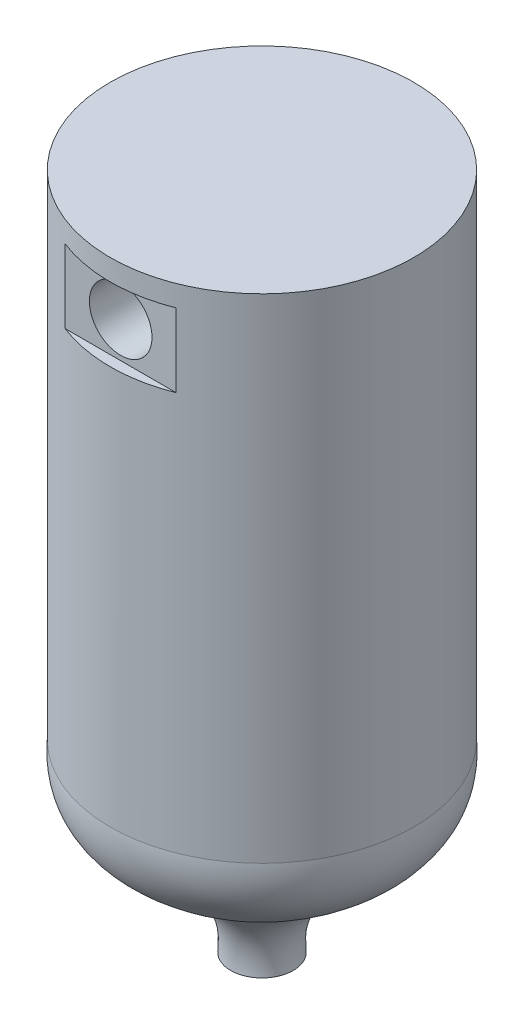
ISO-10303-21;
HEADER;
FILE_DESCRIPTION(('STEP AP214'),'2;1');
FILE_NAME('part.step','',(''),(''),'','','');
FILE_SCHEMA(('AUTOMOTIVE_DESIGN { 1 0 10303 214 1 1 1 1 }'));
ENDSEC;
DATA;
#1=APPLICATION_CONTEXT('core data for automotive mechanical design processes');
#2=APPLICATION_PROTOCOL_DEFINITION('international standard','automotive_design',2000,#1);
#3=PRODUCT_CONTEXT('',#1,'mechanical');
#4=PRODUCT('Part','Part','',(#3));
#5=PRODUCT_RELATED_PRODUCT_CATEGORY('part','',(#4));
#6=PRODUCT_DEFINITION_FORMATION('','',#4);
#7=PRODUCT_DEFINITION_CONTEXT('part definition',#1,'design');
#8=PRODUCT_DEFINITION('design','',#6,#7);
#9=PRODUCT_DEFINITION_SHAPE('','',#8);
#10=(LENGTH_UNIT() NAMED_UNIT(*) SI_UNIT(.MILLI.,.METRE.));
#11=(NAMED_UNIT(*) PLANE_ANGLE_UNIT() SI_UNIT($,.RADIAN.));
#12=(NAMED_UNIT(*) SI_UNIT($,.STERADIAN.) SOLID_ANGLE_UNIT());
#13=UNCERTAINTY_MEASURE_WITH_UNIT(LENGTH_MEASURE(1.E-05),#10,'distance_accuracy_value','');
#14=(GEOMETRIC_REPRESENTATION_CONTEXT(3) GLOBAL_UNCERTAINTY_ASSIGNED_CONTEXT((#13)) GLOBAL_UNIT_ASSIGNED_CONTEXT((#10,
#11,#12)) REPRESENTATION_CONTEXT('',''));
#15=CARTESIAN_POINT('',(0.,0.,0.));
#16=DIRECTION('',(0.,0.,1.));
#17=DIRECTION('',(1.,0.,0.));
#18=AXIS2_PLACEMENT_3D('',#15,#16,#17);
#19=CARTESIAN_POINT('',(0.,0.,0.));
#20=DIRECTION('',(0.,1.,0.));
#21=DIRECTION('',(-1.,0.,0.));
#22=AXIS2_PLACEMENT_3D('',#19,#20,#21);
#23=CYLINDRICAL_SURFACE('',#22,3.87911139565885);
#24=CARTESIAN_POINT('',(-0.8,-1.5,-3.79572196293806));
#25=CARTESIAN_POINT('',(-0.799998392782112,-1.54442061979442,-3.79572285408238));
#26=CARTESIAN_POINT('',(-0.796287694510923,-1.58886117634061,-3.79651021580194));
#27=CARTESIAN_POINT('',(-0.781556560643599,-1.67648295931771,-3.79956958912187));
#28=CARTESIAN_POINT('',(-0.770530459064854,-1.71966318250013,-3.80184275149578));
#29=CARTESIAN_POINT('',(-0.741526750116937,-1.80348402320804,-3.80760557798762));
#30=CARTESIAN_POINT('',(-0.723556286832676,-1.84412720099605,-3.81109399154105));
#31=CARTESIAN_POINT('',(-0.681193827641743,-1.92182130630489,-3.81889277096805));
#32=CARTESIAN_POINT('',(-0.656802116461452,-1.95887239300399,-3.82320310039448));
#33=CARTESIAN_POINT('',(-0.601898782214699,-2.02888891365105,-3.83223242016983));
#34=CARTESIAN_POINT('',(-0.571309052087774,-2.06179250051781,-3.8369561383317));
#35=CARTESIAN_POINT('',(-0.50504672354252,-2.12203951640586,-3.84623845275667));
#36=CARTESIAN_POINT('',(-0.469373756918443,-2.14938254229771,-3.85079703702821));
#37=CARTESIAN_POINT('',(-0.393546355098853,-2.19797377523237,-3.85928660985794));
#38=CARTESIAN_POINT('',(-0.353353351502304,-2.21916297689781,-3.86321137196339));
#39=CARTESIAN_POINT('',(-0.269882972825537,-2.25446400580391,-3.8699378807461));
#40=CARTESIAN_POINT('',(-0.226605905412446,-2.26857653788956,-3.87273973926034));
#41=CARTESIAN_POINT('',(-0.138838139613735,-2.28913044776314,-3.87687134348848));
#42=CARTESIAN_POINT('',(-0.0943728765742623,-2.2956763422445,-3.8782211278944));
#43=CARTESIAN_POINT('',(-0.00495618249461623,-2.30123747449983,-3.8793657789952));
#44=CARTESIAN_POINT('',(0.0399951983903502,-2.30025348190552,-3.87916080460239));
#45=CARTESIAN_POINT('',(0.128389185798366,-2.29086158181682,-3.87723449184737));
#46=CARTESIAN_POINT('',(0.171844331051346,-2.28256627895906,-3.87553615434167));
#47=CARTESIAN_POINT('',(0.256732269614236,-2.25896610713788,-3.87083996468401));
#48=CARTESIAN_POINT('',(0.29816497837797,-2.24366094541072,-3.8678420582564));
#49=CARTESIAN_POINT('',(0.378150356783651,-2.20637272844904,-3.86084596365601));
#50=CARTESIAN_POINT('',(0.416682084477137,-2.18434602239682,-3.85684126810262));
#51=CARTESIAN_POINT('',(0.489543925976474,-2.13427235230499,-3.84827231306354));
#52=CARTESIAN_POINT('',(0.523873526519634,-2.10622465398991,-3.84370798535843));
#53=CARTESIAN_POINT('',(0.588025371097011,-2.04428892783392,-3.83442343740927));
#54=CARTESIAN_POINT('',(0.617752350080449,-2.01030234547937,-3.82970189558812));
#55=CARTESIAN_POINT('',(0.671101070191168,-1.93777827401151,-3.82071493893205));
#56=CARTESIAN_POINT('',(0.694722680745594,-1.89924068759354,-3.81644953385348));
#57=CARTESIAN_POINT('',(0.735226021377531,-1.81856619392341,-3.80885489295633));
#58=CARTESIAN_POINT('',(0.752091498738081,-1.7764208997039,-3.80552792026909));
#59=CARTESIAN_POINT('',(0.778473338030278,-1.68981003087837,-3.80021939111729));
#60=CARTESIAN_POINT('',(0.787990724194981,-1.64534478056829,-3.79823764714913));
#61=CARTESIAN_POINT('',(0.799262103989182,-1.55622191305836,-3.79588174463777));
#62=CARTESIAN_POINT('',(0.801154037092034,-1.51158247638581,-3.795479026235));
#63=CARTESIAN_POINT('',(0.797492723844554,-1.42262593012806,-3.79624998764549));
#64=CARTESIAN_POINT('',(0.791939928240309,-1.37830880119185,-3.79742357202046));
#65=CARTESIAN_POINT('',(0.773665950862599,-1.29172387922307,-3.80118808741802));
#66=CARTESIAN_POINT('',(0.761019203909578,-1.24943967786447,-3.80376429301863));
#67=CARTESIAN_POINT('',(0.728996231177201,-1.16759033724883,-3.81003074527192));
#68=CARTESIAN_POINT('',(0.709619421424354,-1.1280254343047,-3.81372108859568));
#69=CARTESIAN_POINT('',(0.664376820727592,-1.05213635320076,-3.82186371227889));
#70=CARTESIAN_POINT('',(0.63842515045615,-1.01586444743372,-3.82632580696469));
#71=CARTESIAN_POINT('',(0.580883292506621,-0.948139934328074,-3.83548258276478));
#72=CARTESIAN_POINT('',(0.549292485930182,-0.91668785667315,-3.84017728936745));
#73=CARTESIAN_POINT('',(0.48074824891789,-0.85896880756651,-3.84936347743921));
#74=CARTESIAN_POINT('',(0.443715350921709,-0.832795355912522,-3.85385036190822));
#75=CARTESIAN_POINT('',(0.365698019813777,-0.787041611941237,-3.86203396043281));
#76=CARTESIAN_POINT('',(0.324713759269478,-0.767461031861767,-3.86573070897327));
#77=CARTESIAN_POINT('',(0.240196445225864,-0.735583211454443,-3.87189796037685));
#78=CARTESIAN_POINT('',(0.196680152273248,-0.723242993710066,-3.87437568465958));
#79=CARTESIAN_POINT('',(0.108135898251057,-0.706060608034552,-3.87785677158642));
#80=CARTESIAN_POINT('',(0.0631081321179846,-0.70121747696232,-3.8788603236147));
#81=CARTESIAN_POINT('',(-0.0262894265731106,-0.699205995510294,-3.87927514401801));
#82=CARTESIAN_POINT('',(-0.0706559869636904,-0.701897364428881,-3.87871551680126));
#83=CARTESIAN_POINT('',(-0.158290045514602,-0.714567440441437,-3.87612842708305));
#84=CARTESIAN_POINT('',(-0.201557559320991,-0.724546043733898,-3.87410098548958));
#85=CARTESIAN_POINT('',(-0.285671057304302,-0.751443363730176,-3.8688073284484));
#86=CARTESIAN_POINT('',(-0.326522961538451,-0.768344234049128,-3.86554430010365));
#87=CARTESIAN_POINT('',(-0.404830836089458,-0.808588085630284,-3.8581298581776));
#88=CARTESIAN_POINT('',(-0.442286517244255,-0.831931614751963,-3.85397836905169));
#89=CARTESIAN_POINT('',(-0.513429370444803,-0.884866255969008,-3.84515329944585));
#90=CARTESIAN_POINT('',(-0.54704132495535,-0.914557185424199,-3.84047201842704));
#91=CARTESIAN_POINT('',(-0.608853942743891,-0.97913990388469,-3.83115929512193));
#92=CARTESIAN_POINT('',(-0.637053316274211,-1.01403292897113,-3.82652786496201));
#93=CARTESIAN_POINT('',(-0.687552360876838,-1.08851508080994,-3.81777987422504));
#94=CARTESIAN_POINT('',(-0.709779851600872,-1.12815395706249,-3.8136699045256));
#95=CARTESIAN_POINT('',(-0.747223153517667,-1.21067870534942,-3.80651140118416));
#96=CARTESIAN_POINT('',(-0.762445188715097,-1.25356165558086,-3.80346192593567));
#97=CARTESIAN_POINT('',(-0.782568890827868,-1.33043756008444,-3.79936400567457));
#98=CARTESIAN_POINT('',(-0.789093594230016,-1.36399864820687,-3.79800689514546));
#99=CARTESIAN_POINT('',(-0.797809682807601,-1.43170257711529,-3.79618554846753));
#100=CARTESIAN_POINT('',(-0.800001235775004,-1.4658453953234,-3.79572127774541));
#101=CARTESIAN_POINT('',(-0.8,-1.5,-3.79572196293806));
#102=B_SPLINE_CURVE_WITH_KNOTS('',3,(#24,#25,#26,#27,#28,#29,#30,#31,#32,#33,#34,#35,#36,#37,
#38,#39,#40,#41,#42,#43,#44,#45,#46,#47,#48,#49,#50,#51,#52,#53,#54,#55,#56,#57,#58,#59,#60,#61,
#62,#63,#64,#65,#66,#67,#68,#69,#70,#71,#72,#73,#74,#75,#76,#77,#78,#79,#80,#81,#82,#83,#84,#85,
#86,#87,#88,#89,#90,#91,#92,#93,#94,#95,#96,#97,#98,#99,#100,#101),.UNSPECIFIED.,.T.,.F.,(4,2,2,
2,2,2,2,2,2,2,2,2,2,2,2,2,2,2,2,2,2,2,2,2,2,2,2,2,2,2,2,2,2,2,2,2,2,2,4),(0.,0.133136766295774,
0.266376771275506,0.399480067557613,0.532577462862407,0.667470055826386,0.802372424747071,
0.938528541209149,1.07467109365982,1.20890977235484,1.34313473066304,1.47532786498706,
1.60752652080412,1.74060265724483,1.87369503189072,2.00925260169266,2.14481307036541,
2.28069771596252,2.41656341749902,2.54996005851149,2.68334862329972,2.81536307804686,
2.94738899066775,3.08123733777128,3.21510038384746,3.35115931583791,3.48721230842995,
3.62244932513009,3.75766896666209,3.89038785985795,4.02310486260375,4.15548183838396,
4.28787007447455,4.42251752368615,4.5571970179101,4.69343775221293,4.82955720849509,
4.93192880380254,5.03429643491165),.UNSPECIFIED.);
#103=CARTESIAN_POINT('',(-0.8,-1.5,-3.79572196293806));
#104=VERTEX_POINT('',#103);
#105=EDGE_CURVE('E77',#104,#104,#102,.T.);
#106=ORIENTED_EDGE('',*,*,#105,.T.);
#107=EDGE_LOOP('',(#106));
#108=FACE_BOUND('',#107,.T.);
#109=CARTESIAN_POINT('',(0.,-12.6027502968154,0.));
#110=DIRECTION('',(0.,1.,0.));
#111=DIRECTION('',(-1.,0.,0.));
#112=AXIS2_PLACEMENT_3D('',#109,#110,#111);
#113=CIRCLE('',#112,3.87911139565885);
#114=CARTESIAN_POINT('',(-3.87911139565885,-12.6027502968154,0.));
#115=VERTEX_POINT('',#114);
#116=EDGE_CURVE('E119',#115,#115,#113,.T.);
#117=ORIENTED_EDGE('',*,*,#116,.T.);
#118=EDGE_LOOP('',(#117));
#119=FACE_BOUND('',#118,.T.);
#120=CARTESIAN_POINT('',(0.,0.,0.));
#121=DIRECTION('',(0.,1.,0.));
#122=DIRECTION('',(-1.,0.,0.));
#123=AXIS2_PLACEMENT_3D('',#120,#121,#122);
#124=CIRCLE('',#123,3.87911139565885);
#125=CARTESIAN_POINT('',(-3.87911139565885,0.,0.));
#126=VERTEX_POINT('',#125);
#127=EDGE_CURVE('E84',#126,#126,#124,.T.);
#128=ORIENTED_EDGE('',*,*,#127,.F.);
#129=EDGE_LOOP('',(#128));
#130=FACE_BOUND('',#129,.T.);
#131=CARTESIAN_POINT('',(0.,-2.41617686288383,0.));
#132=DIRECTION('',(0.,1.,0.));
#133=DIRECTION('',(0.,0.,1.));
#134=AXIS2_PLACEMENT_3D('',#131,#132,#133);
#135=CIRCLE('',#134,3.87911139565885);
#136=CARTESIAN_POINT('',(1.41825667161871,-2.41617686288383,3.61054749772654));
#137=VERTEX_POINT('',#136);
#138=CARTESIAN_POINT('',(-1.4182566716187,-2.41617686288383,3.61054749772654));
#139=VERTEX_POINT('',#138);
#140=EDGE_CURVE('E11',#137,#139,#135,.F.);
#141=ORIENTED_EDGE('',*,*,#140,.T.);
#142=DIRECTION('',(0.,1.,0.));
#143=VECTOR('',#142,1.);
#144=CARTESIAN_POINT('',(-1.4182566716187,0.,3.61054749772654));
#145=LINE('',#144,#143);
#146=CARTESIAN_POINT('',(-1.4182566716187,-0.539756512881117,3.61054749772654));
#147=VERTEX_POINT('',#146);
#148=EDGE_CURVE('E71',#139,#147,#145,.T.);
#149=ORIENTED_EDGE('',*,*,#148,.T.);
#150=CARTESIAN_POINT('',(0.,-0.539756512881117,0.));
#151=DIRECTION('',(0.,-1.,0.));
#152=DIRECTION('',(0.,0.,-1.));
#153=AXIS2_PLACEMENT_3D('',#150,#151,#152);
#154=CIRCLE('',#153,3.87911139565885);
#155=CARTESIAN_POINT('',(1.41825667161871,-0.539756512881117,3.61054749772654));
#156=VERTEX_POINT('',#155);
#157=EDGE_CURVE('E44',#147,#156,#154,.F.);
#158=ORIENTED_EDGE('',*,*,#157,.T.);
#159=DIRECTION('',(0.,1.,0.));
#160=VECTOR('',#159,1.);
#161=CARTESIAN_POINT('',(1.4182566716187,0.,3.61054749772654));
#162=LINE('',#161,#160);
#163=EDGE_CURVE('E70',#156,#137,#162,.F.);
#164=ORIENTED_EDGE('',*,*,#163,.T.);
#165=EDGE_LOOP('',(#141,#149,#158,#164));
#166=FACE_BOUND('',#165,.T.);
#167=ADVANCED_FACE('F36',(#108,#119,#130,#166),#23,.T.);
#168=CARTESIAN_POINT('',(-3.87911139565885,0.,0.));
#169=DIRECTION('',(0.,1.,0.));
#170=DIRECTION('',(-1.,0.,0.));
#171=AXIS2_PLACEMENT_3D('',#168,#169,#170);
#172=PLANE('',#171);
#173=ORIENTED_EDGE('',*,*,#127,.T.);
#174=EDGE_LOOP('',(#173));
#175=FACE_BOUND('',#174,.T.);
#176=ADVANCED_FACE('F38',(#175),#172,.T.);
#177=CARTESIAN_POINT('',(-0.8,-17.316571149834,0.));
#178=DIRECTION('',(0.,-1.,0.));
#179=DIRECTION('',(1.,0.,0.));
#180=AXIS2_PLACEMENT_3D('',#177,#178,#179);
#181=PLANE('',#180);
#182=CARTESIAN_POINT('',(0.,-17.316571149834,0.));
#183=DIRECTION('',(0.,1.,0.));
#184=DIRECTION('',(-1.,0.,0.));
#185=AXIS2_PLACEMENT_3D('',#182,#183,#184);
#186=CIRCLE('',#185,0.800000000000004);
#187=CARTESIAN_POINT('',(-0.8,-17.316571149834,0.));
#188=VERTEX_POINT('',#187);
#189=EDGE_CURVE('E122',#188,#188,#186,.T.);
#190=ORIENTED_EDGE('',*,*,#189,.F.);
#191=EDGE_LOOP('',(#190));
#192=FACE_BOUND('',#191,.T.);
#193=ADVANCED_FACE('F98',(#192),#181,.T.);
#194=CARTESIAN_POINT('',(-3.87911139565885,-12.6027502968154,0.));
#195=CARTESIAN_POINT('',(-4.09845442398315,-15.2494218995746,0.));
#196=CARTESIAN_POINT('',(-0.534839258085725,-14.7259413935813,0.));
#197=CARTESIAN_POINT('',(-0.8,-17.316571149834,0.));
#198=B_SPLINE_CURVE_WITH_KNOTS('',3,(#194,#195,#196,#197),.UNSPECIFIED.,.F.,.F.,(4,4),(0.,1.),.UNSPECIFIED.);
#199=CARTESIAN_POINT('',(0.,0.,0.));
#200=DIRECTION('',(0.,1.,0.));
#201=AXIS1_PLACEMENT('',#199,#200);
#202=SURFACE_OF_REVOLUTION('',#198,#201);
#203=ORIENTED_EDGE('',*,*,#189,.T.);
#204=EDGE_LOOP('',(#203));
#205=FACE_BOUND('',#204,.T.);
#206=ORIENTED_EDGE('',*,*,#116,.F.);
#207=EDGE_LOOP('',(#206));
#208=FACE_BOUND('',#207,.T.);
#209=ADVANCED_FACE('F94',(#205,#208),#202,.F.);
#210=CARTESIAN_POINT('',(0.,-1.5,-1.9));
#211=DIRECTION('',(0.,0.,-1.));
#212=DIRECTION('',(-1.,0.,0.));
#213=AXIS2_PLACEMENT_3D('',#210,#211,#212);
#214=CYLINDRICAL_SURFACE('',#213,0.8);
#215=ORIENTED_EDGE('',*,*,#105,.F.);
#216=EDGE_LOOP('',(#215));
#217=FACE_BOUND('',#216,.T.);
#218=CARTESIAN_POINT('',(0.,-1.5,-1.9));
#219=DIRECTION('',(0.,0.,1.));
#220=DIRECTION('',(1.,0.,0.));
#221=AXIS2_PLACEMENT_3D('',#218,#219,#220);
#222=CIRCLE('',#221,0.8);
#223=CARTESIAN_POINT('',(0.8,-1.5,-1.9));
#224=VERTEX_POINT('',#223);
#225=EDGE_CURVE('E74',#224,#224,#222,.T.);
#226=ORIENTED_EDGE('',*,*,#225,.T.);
#227=EDGE_LOOP('',(#226));
#228=FACE_BOUND('',#227,.T.);
#229=ADVANCED_FACE('F97',(#217,#228),#214,.F.);
#230=CARTESIAN_POINT('',(0.,-1.5,-1.9));
#231=DIRECTION('',(0.,0.,1.));
#232=DIRECTION('',(1.,0.,0.));
#233=AXIS2_PLACEMENT_3D('',#230,#231,#232);
#234=PLANE('',#233);
#235=ORIENTED_EDGE('',*,*,#225,.F.);
#236=EDGE_LOOP('',(#235));
#237=FACE_BOUND('',#236,.T.);
#238=ADVANCED_FACE('F135',(#237),#234,.F.);
#239=CARTESIAN_POINT('',(5.,-0.539756512881117,3.61054749772654));
#240=DIRECTION('',(0.,0.,1.));
#241=DIRECTION('',(1.,0.,0.));
#242=AXIS2_PLACEMENT_3D('',#239,#240,#241);
#243=PLANE('',#242);
#244=DIRECTION('',(-1.,0.,0.));
#245=VECTOR('',#244,1.);
#246=CARTESIAN_POINT('',(5.,-0.539756512881117,3.61054749772654));
#247=LINE('',#246,#245);
#248=EDGE_CURVE('E50',#156,#147,#247,.T.);
#249=ORIENTED_EDGE('',*,*,#248,.T.);
#250=ORIENTED_EDGE('',*,*,#148,.F.);
#251=DIRECTION('',(-1.,0.,0.));
#252=VECTOR('',#251,1.);
#253=CARTESIAN_POINT('',(5.,-2.41617686288383,3.61054749772654));
#254=LINE('',#253,#252);
#255=EDGE_CURVE('E62',#137,#139,#254,.T.);
#256=ORIENTED_EDGE('',*,*,#255,.F.);
#257=ORIENTED_EDGE('',*,*,#163,.F.);
#258=EDGE_LOOP('',(#249,#250,#256,#257));
#259=FACE_BOUND('',#258,.T.);
#260=CARTESIAN_POINT('',(0.,-1.5,3.61054749772654));
#261=DIRECTION('',(0.,0.,1.));
#262=DIRECTION('',(1.,0.,0.));
#263=AXIS2_PLACEMENT_3D('',#260,#261,#262);
#264=CIRCLE('',#263,0.8);
#265=CARTESIAN_POINT('',(0.8,-1.5,3.61054749772654));
#266=VERTEX_POINT('',#265);
#267=EDGE_CURVE('E72',#266,#266,#264,.F.);
#268=ORIENTED_EDGE('',*,*,#267,.T.);
#269=EDGE_LOOP('',(#268));
#270=FACE_BOUND('',#269,.T.);
#271=ADVANCED_FACE('F68',(#259,#270),#243,.T.);
#272=CARTESIAN_POINT('',(5.,-2.41617686288383,3.61054749772654));
#273=DIRECTION('',(0.,1.,0.));
#274=DIRECTION('',(0.,0.,1.));
#275=AXIS2_PLACEMENT_3D('',#272,#273,#274);
#276=PLANE('',#275);
#277=ORIENTED_EDGE('',*,*,#140,.F.);
#278=ORIENTED_EDGE('',*,*,#255,.T.);
#279=EDGE_LOOP('',(#277,#278));
#280=FACE_BOUND('',#279,.T.);
#281=ADVANCED_FACE('F61',(#280),#276,.T.);
#282=CARTESIAN_POINT('',(5.,-0.539756512881117,3.87911139565885));
#283=DIRECTION('',(0.,-1.,0.));
#284=DIRECTION('',(0.,0.,-1.));
#285=AXIS2_PLACEMENT_3D('',#282,#283,#284);
#286=PLANE('',#285);
#287=ORIENTED_EDGE('',*,*,#248,.F.);
#288=ORIENTED_EDGE('',*,*,#157,.F.);
#289=EDGE_LOOP('',(#287,#288));
#290=FACE_BOUND('',#289,.T.);
#291=ADVANCED_FACE('F141',(#290),#286,.T.);
#292=CARTESIAN_POINT('',(0.,-1.5,1.9));
#293=DIRECTION('',(0.,0.,1.));
#294=DIRECTION('',(1.,0.,0.));
#295=AXIS2_PLACEMENT_3D('',#292,#293,#294);
#296=PLANE('',#295);
#297=CARTESIAN_POINT('',(0.,-1.5,1.9));
#298=DIRECTION('',(0.,0.,1.));
#299=DIRECTION('',(1.,0.,0.));
#300=AXIS2_PLACEMENT_3D('',#297,#298,#299);
#301=CIRCLE('',#300,0.8);
#302=CARTESIAN_POINT('',(0.8,-1.5,1.9));
#303=VERTEX_POINT('',#302);
#304=EDGE_CURVE('E81',#303,#303,#301,.T.);
#305=ORIENTED_EDGE('',*,*,#304,.T.);
#306=EDGE_LOOP('',(#305));
#307=FACE_BOUND('',#306,.T.);
#308=ADVANCED_FACE('F138',(#307),#296,.T.);
#309=CARTESIAN_POINT('',(0.,-1.5,1.9));
#310=DIRECTION('',(0.,0.,1.));
#311=DIRECTION('',(1.,0.,0.));
#312=AXIS2_PLACEMENT_3D('',#309,#310,#311);
#313=CYLINDRICAL_SURFACE('',#312,0.8);
#314=ORIENTED_EDGE('',*,*,#304,.F.);
#315=EDGE_LOOP('',(#314));
#316=FACE_BOUND('',#315,.T.);
#317=ORIENTED_EDGE('',*,*,#267,.F.);
#318=EDGE_LOOP('',(#317));
#319=FACE_BOUND('',#318,.T.);
#320=ADVANCED_FACE('F140',(#316,#319),#313,.F.);
#321=CLOSED_SHELL('',(#167,#176,#193,#209,#229,#238,#271,#281,#291,#308,#320));
#322=MANIFOLD_SOLID_BREP('B2',#321);
#323=ADVANCED_BREP_SHAPE_REPRESENTATION('',(#18,#322),#14);
#324=SHAPE_DEFINITION_REPRESENTATION(#9,#323);
ENDSEC;
END-ISO-10303-21;
